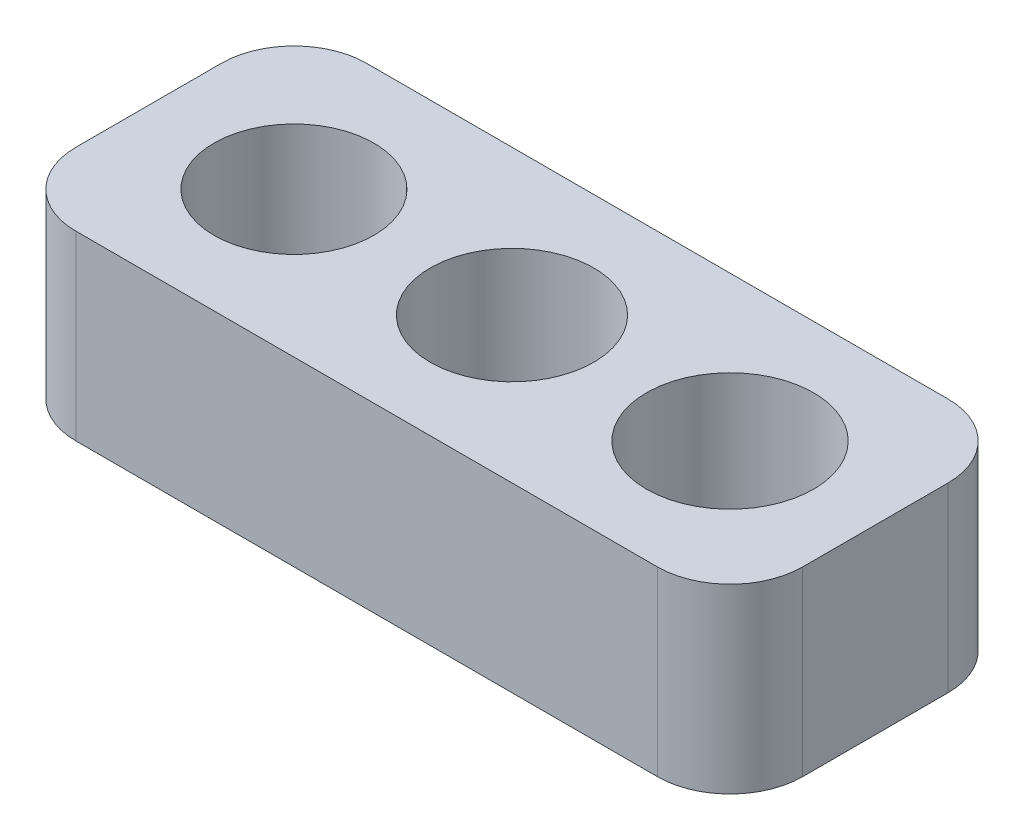
ISO-10303-21;
HEADER;
FILE_DESCRIPTION(('STEP AP214'),'2;1');
FILE_NAME('part.step','',(''),(''),'','','');
FILE_SCHEMA(('AUTOMOTIVE_DESIGN { 1 0 10303 214 1 1 1 1 }'));
ENDSEC;
DATA;
#1=APPLICATION_CONTEXT('core data for automotive mechanical design processes');
#2=APPLICATION_PROTOCOL_DEFINITION('international standard','automotive_design',2000,#1);
#3=PRODUCT_CONTEXT('',#1,'mechanical');
#4=PRODUCT('Part','Part','',(#3));
#5=PRODUCT_RELATED_PRODUCT_CATEGORY('part','',(#4));
#6=PRODUCT_DEFINITION_FORMATION('','',#4);
#7=PRODUCT_DEFINITION_CONTEXT('part definition',#1,'design');
#8=PRODUCT_DEFINITION('design','',#6,#7);
#9=PRODUCT_DEFINITION_SHAPE('','',#8);
#10=(LENGTH_UNIT() NAMED_UNIT(*) SI_UNIT(.MILLI.,.METRE.));
#11=(NAMED_UNIT(*) PLANE_ANGLE_UNIT() SI_UNIT($,.RADIAN.));
#12=(NAMED_UNIT(*) SI_UNIT($,.STERADIAN.) SOLID_ANGLE_UNIT());
#13=UNCERTAINTY_MEASURE_WITH_UNIT(LENGTH_MEASURE(1.E-05),#10,'distance_accuracy_value','');
#14=(GEOMETRIC_REPRESENTATION_CONTEXT(3) GLOBAL_UNCERTAINTY_ASSIGNED_CONTEXT((#13)) GLOBAL_UNIT_ASSIGNED_CONTEXT((#10,
#11,#12)) REPRESENTATION_CONTEXT('',''));
#15=CARTESIAN_POINT('',(0.,0.,0.));
#16=DIRECTION('',(0.,0.,1.));
#17=DIRECTION('',(1.,0.,0.));
#18=AXIS2_PLACEMENT_3D('',#15,#16,#17);
#19=CARTESIAN_POINT('',(0.,5.,0.));
#20=DIRECTION('',(0.,1.,0.));
#21=DIRECTION('',(0.,0.,1.));
#22=AXIS2_PLACEMENT_3D('',#19,#20,#21);
#23=PLANE('',#22);
#24=CARTESIAN_POINT('',(0.,5.,0.));
#25=DIRECTION('',(0.,1.,0.));
#26=DIRECTION('',(0.,0.,1.));
#27=AXIS2_PLACEMENT_3D('',#24,#25,#26);
#28=CIRCLE('',#27,2.25);
#29=CARTESIAN_POINT('',(0.,5.,2.25));
#30=VERTEX_POINT('',#29);
#31=EDGE_CURVE('E182',#30,#30,#28,.T.);
#32=ORIENTED_EDGE('',*,*,#31,.F.);
#33=EDGE_LOOP('',(#32));
#34=FACE_BOUND('',#33,.T.);
#35=DIRECTION('',(-1.,0.,0.));
#36=VECTOR('',#35,1.);
#37=CARTESIAN_POINT('',(-10.,5.,-4.));
#38=LINE('',#37,#36);
#39=CARTESIAN_POINT('',(8.,5.,-4.));
#40=VERTEX_POINT('',#39);
#41=CARTESIAN_POINT('',(-8.,5.,-4.));
#42=VERTEX_POINT('',#41);
#43=EDGE_CURVE('E177',#40,#42,#38,.T.);
#44=ORIENTED_EDGE('',*,*,#43,.T.);
#45=CARTESIAN_POINT('',(-8.,5.,-2.));
#46=DIRECTION('',(0.,1.,0.));
#47=DIRECTION('',(0.,0.,1.));
#48=AXIS2_PLACEMENT_3D('',#45,#46,#47);
#49=CIRCLE('',#48,2.);
#50=CARTESIAN_POINT('',(-10.,5.,-2.));
#51=VERTEX_POINT('',#50);
#52=EDGE_CURVE('E154',#42,#51,#49,.T.);
#53=ORIENTED_EDGE('',*,*,#52,.T.);
#54=DIRECTION('',(0.,0.,1.));
#55=VECTOR('',#54,1.);
#56=CARTESIAN_POINT('',(-10.,5.,-4.));
#57=LINE('',#56,#55);
#58=CARTESIAN_POINT('',(-10.,5.,2.));
#59=VERTEX_POINT('',#58);
#60=EDGE_CURVE('E124',#51,#59,#57,.T.);
#61=ORIENTED_EDGE('',*,*,#60,.T.);
#62=CARTESIAN_POINT('',(-8.,5.,2.));
#63=DIRECTION('',(0.,1.,0.));
#64=DIRECTION('',(0.,0.,1.));
#65=AXIS2_PLACEMENT_3D('',#62,#63,#64);
#66=CIRCLE('',#65,2.);
#67=CARTESIAN_POINT('',(-8.,5.,4.));
#68=VERTEX_POINT('',#67);
#69=EDGE_CURVE('E61',#59,#68,#66,.T.);
#70=ORIENTED_EDGE('',*,*,#69,.T.);
#71=DIRECTION('',(1.,0.,0.));
#72=VECTOR('',#71,1.);
#73=CARTESIAN_POINT('',(-10.,5.,4.));
#74=LINE('',#73,#72);
#75=CARTESIAN_POINT('',(8.,5.,4.));
#76=VERTEX_POINT('',#75);
#77=EDGE_CURVE('E140',#68,#76,#74,.T.);
#78=ORIENTED_EDGE('',*,*,#77,.T.);
#79=CARTESIAN_POINT('',(8.,5.,2.));
#80=DIRECTION('',(0.,1.,0.));
#81=DIRECTION('',(0.,0.,1.));
#82=AXIS2_PLACEMENT_3D('',#79,#80,#81);
#83=CIRCLE('',#82,2.);
#84=CARTESIAN_POINT('',(10.,5.,2.));
#85=VERTEX_POINT('',#84);
#86=EDGE_CURVE('E149',#76,#85,#83,.T.);
#87=ORIENTED_EDGE('',*,*,#86,.T.);
#88=DIRECTION('',(0.,0.,-1.));
#89=VECTOR('',#88,1.);
#90=CARTESIAN_POINT('',(10.,5.,-4.));
#91=LINE('',#90,#89);
#92=CARTESIAN_POINT('',(10.,5.,-2.));
#93=VERTEX_POINT('',#92);
#94=EDGE_CURVE('E134',#85,#93,#91,.T.);
#95=ORIENTED_EDGE('',*,*,#94,.T.);
#96=CARTESIAN_POINT('',(8.,5.,-2.));
#97=DIRECTION('',(0.,1.,0.));
#98=DIRECTION('',(0.,0.,1.));
#99=AXIS2_PLACEMENT_3D('',#96,#97,#98);
#100=CIRCLE('',#99,2.);
#101=EDGE_CURVE('E151',#93,#40,#100,.T.);
#102=ORIENTED_EDGE('',*,*,#101,.T.);
#103=EDGE_LOOP('',(#44,#53,#61,#70,#78,#87,#95,#102));
#104=FACE_BOUND('',#103,.T.);
#105=CARTESIAN_POINT('',(-6.,5.,0.));
#106=DIRECTION('',(0.,1.,0.));
#107=DIRECTION('',(0.,0.,1.));
#108=AXIS2_PLACEMENT_3D('',#105,#106,#107);
#109=CIRCLE('',#108,2.2);
#110=CARTESIAN_POINT('',(-6.,5.,2.2));
#111=VERTEX_POINT('',#110);
#112=EDGE_CURVE('E170',#111,#111,#109,.T.);
#113=ORIENTED_EDGE('',*,*,#112,.F.);
#114=EDGE_LOOP('',(#113));
#115=FACE_BOUND('',#114,.T.);
#116=CARTESIAN_POINT('',(6.,5.,0.));
#117=DIRECTION('',(0.,1.,0.));
#118=DIRECTION('',(0.,0.,1.));
#119=AXIS2_PLACEMENT_3D('',#116,#117,#118);
#120=CIRCLE('',#119,2.3);
#121=CARTESIAN_POINT('',(6.,5.,2.3));
#122=VERTEX_POINT('',#121);
#123=EDGE_CURVE('E187',#122,#122,#120,.T.);
#124=ORIENTED_EDGE('',*,*,#123,.F.);
#125=EDGE_LOOP('',(#124));
#126=FACE_BOUND('',#125,.T.);
#127=ADVANCED_FACE('F39',(#34,#104,#115,#126),#23,.T.);
#128=CARTESIAN_POINT('',(0.,0.,0.));
#129=DIRECTION('',(0.,1.,0.));
#130=DIRECTION('',(0.,0.,1.));
#131=AXIS2_PLACEMENT_3D('',#128,#129,#130);
#132=PLANE('',#131);
#133=DIRECTION('',(0.,0.,1.));
#134=VECTOR('',#133,1.);
#135=CARTESIAN_POINT('',(-10.,0.,-4.));
#136=LINE('',#135,#134);
#137=CARTESIAN_POINT('',(-10.,0.,-2.));
#138=VERTEX_POINT('',#137);
#139=CARTESIAN_POINT('',(-10.,0.,2.));
#140=VERTEX_POINT('',#139);
#141=EDGE_CURVE('E122',#138,#140,#136,.T.);
#142=ORIENTED_EDGE('',*,*,#141,.F.);
#143=CARTESIAN_POINT('',(-8.,0.,-2.));
#144=DIRECTION('',(0.,1.,0.));
#145=DIRECTION('',(0.,0.,1.));
#146=AXIS2_PLACEMENT_3D('',#143,#144,#145);
#147=CIRCLE('',#146,2.);
#148=CARTESIAN_POINT('',(-8.,0.,-4.));
#149=VERTEX_POINT('',#148);
#150=EDGE_CURVE('E105',#138,#149,#147,.F.);
#151=ORIENTED_EDGE('',*,*,#150,.T.);
#152=DIRECTION('',(-1.,0.,0.));
#153=VECTOR('',#152,1.);
#154=CARTESIAN_POINT('',(-10.,0.,-4.));
#155=LINE('',#154,#153);
#156=CARTESIAN_POINT('',(8.,0.,-4.));
#157=VERTEX_POINT('',#156);
#158=EDGE_CURVE('E132',#157,#149,#155,.T.);
#159=ORIENTED_EDGE('',*,*,#158,.F.);
#160=CARTESIAN_POINT('',(8.,0.,-2.));
#161=DIRECTION('',(0.,1.,0.));
#162=DIRECTION('',(0.,0.,1.));
#163=AXIS2_PLACEMENT_3D('',#160,#161,#162);
#164=CIRCLE('',#163,2.);
#165=CARTESIAN_POINT('',(10.,0.,-2.));
#166=VERTEX_POINT('',#165);
#167=EDGE_CURVE('E143',#157,#166,#164,.F.);
#168=ORIENTED_EDGE('',*,*,#167,.T.);
#169=DIRECTION('',(0.,0.,-1.));
#170=VECTOR('',#169,1.);
#171=CARTESIAN_POINT('',(10.,0.,-4.));
#172=LINE('',#171,#170);
#173=CARTESIAN_POINT('',(10.,0.,2.));
#174=VERTEX_POINT('',#173);
#175=EDGE_CURVE('E136',#174,#166,#172,.T.);
#176=ORIENTED_EDGE('',*,*,#175,.F.);
#177=CARTESIAN_POINT('',(8.,0.,2.));
#178=DIRECTION('',(0.,1.,0.));
#179=DIRECTION('',(0.,0.,1.));
#180=AXIS2_PLACEMENT_3D('',#177,#178,#179);
#181=CIRCLE('',#180,2.);
#182=CARTESIAN_POINT('',(8.,0.,4.));
#183=VERTEX_POINT('',#182);
#184=EDGE_CURVE('E125',#174,#183,#181,.F.);
#185=ORIENTED_EDGE('',*,*,#184,.T.);
#186=DIRECTION('',(1.,0.,0.));
#187=VECTOR('',#186,1.);
#188=CARTESIAN_POINT('',(-10.,0.,4.));
#189=LINE('',#188,#187);
#190=CARTESIAN_POINT('',(-8.,0.,4.));
#191=VERTEX_POINT('',#190);
#192=EDGE_CURVE('E131',#191,#183,#189,.T.);
#193=ORIENTED_EDGE('',*,*,#192,.F.);
#194=CARTESIAN_POINT('',(-8.,0.,2.));
#195=DIRECTION('',(0.,1.,0.));
#196=DIRECTION('',(0.,0.,1.));
#197=AXIS2_PLACEMENT_3D('',#194,#195,#196);
#198=CIRCLE('',#197,2.);
#199=EDGE_CURVE('E116',#191,#140,#198,.F.);
#200=ORIENTED_EDGE('',*,*,#199,.T.);
#201=EDGE_LOOP('',(#142,#151,#159,#168,#176,#185,#193,#200));
#202=FACE_BOUND('',#201,.T.);
#203=CARTESIAN_POINT('',(-6.,0.,0.));
#204=DIRECTION('',(0.,1.,0.));
#205=DIRECTION('',(0.,0.,1.));
#206=AXIS2_PLACEMENT_3D('',#203,#204,#205);
#207=CIRCLE('',#206,2.2);
#208=CARTESIAN_POINT('',(-6.,0.,2.2));
#209=VERTEX_POINT('',#208);
#210=EDGE_CURVE('E172',#209,#209,#207,.T.);
#211=ORIENTED_EDGE('',*,*,#210,.T.);
#212=EDGE_LOOP('',(#211));
#213=FACE_BOUND('',#212,.T.);
#214=CARTESIAN_POINT('',(0.,0.,0.));
#215=DIRECTION('',(0.,1.,0.));
#216=DIRECTION('',(0.,0.,1.));
#217=AXIS2_PLACEMENT_3D('',#214,#215,#216);
#218=CIRCLE('',#217,2.25);
#219=CARTESIAN_POINT('',(0.,0.,2.25));
#220=VERTEX_POINT('',#219);
#221=EDGE_CURVE('E184',#220,#220,#218,.T.);
#222=ORIENTED_EDGE('',*,*,#221,.T.);
#223=EDGE_LOOP('',(#222));
#224=FACE_BOUND('',#223,.T.);
#225=CARTESIAN_POINT('',(6.,0.,0.));
#226=DIRECTION('',(0.,1.,0.));
#227=DIRECTION('',(0.,0.,1.));
#228=AXIS2_PLACEMENT_3D('',#225,#226,#227);
#229=CIRCLE('',#228,2.3);
#230=CARTESIAN_POINT('',(6.,0.,2.3));
#231=VERTEX_POINT('',#230);
#232=EDGE_CURVE('E190',#231,#231,#229,.T.);
#233=ORIENTED_EDGE('',*,*,#232,.T.);
#234=EDGE_LOOP('',(#233));
#235=FACE_BOUND('',#234,.T.);
#236=ADVANCED_FACE('F128',(#202,#213,#224,#235),#132,.F.);
#237=CARTESIAN_POINT('',(10.,5.,-4.));
#238=DIRECTION('',(-1.,0.,0.));
#239=DIRECTION('',(0.,0.,1.));
#240=AXIS2_PLACEMENT_3D('',#237,#238,#239);
#241=PLANE('',#240);
#242=ORIENTED_EDGE('',*,*,#175,.T.);
#243=DIRECTION('',(0.,-1.,0.));
#244=VECTOR('',#243,1.);
#245=CARTESIAN_POINT('',(10.,5.,-2.));
#246=LINE('',#245,#244);
#247=EDGE_CURVE('E11',#166,#93,#246,.F.);
#248=ORIENTED_EDGE('',*,*,#247,.T.);
#249=ORIENTED_EDGE('',*,*,#94,.F.);
#250=DIRECTION('',(0.,-1.,0.));
#251=VECTOR('',#250,1.);
#252=CARTESIAN_POINT('',(10.,5.,2.));
#253=LINE('',#252,#251);
#254=EDGE_CURVE('E47',#85,#174,#253,.T.);
#255=ORIENTED_EDGE('',*,*,#254,.T.);
#256=EDGE_LOOP('',(#242,#248,#249,#255));
#257=FACE_BOUND('',#256,.T.);
#258=ADVANCED_FACE('F165',(#257),#241,.F.);
#259=CARTESIAN_POINT('',(-10.,5.,-4.));
#260=DIRECTION('',(0.,0.,1.));
#261=DIRECTION('',(1.,0.,0.));
#262=AXIS2_PLACEMENT_3D('',#259,#260,#261);
#263=PLANE('',#262);
#264=ORIENTED_EDGE('',*,*,#158,.T.);
#265=DIRECTION('',(0.,-1.,0.));
#266=VECTOR('',#265,1.);
#267=CARTESIAN_POINT('',(-8.,5.,-4.));
#268=LINE('',#267,#266);
#269=EDGE_CURVE('E110',#149,#42,#268,.F.);
#270=ORIENTED_EDGE('',*,*,#269,.T.);
#271=ORIENTED_EDGE('',*,*,#43,.F.);
#272=DIRECTION('',(0.,-1.,0.));
#273=VECTOR('',#272,1.);
#274=CARTESIAN_POINT('',(8.,5.,-4.));
#275=LINE('',#274,#273);
#276=EDGE_CURVE('E115',#40,#157,#275,.T.);
#277=ORIENTED_EDGE('',*,*,#276,.T.);
#278=EDGE_LOOP('',(#264,#270,#271,#277));
#279=FACE_BOUND('',#278,.T.);
#280=ADVANCED_FACE('F217',(#279),#263,.F.);
#281=CARTESIAN_POINT('',(-10.,5.,-4.));
#282=DIRECTION('',(1.,0.,0.));
#283=DIRECTION('',(0.,0.,-1.));
#284=AXIS2_PLACEMENT_3D('',#281,#282,#283);
#285=PLANE('',#284);
#286=ORIENTED_EDGE('',*,*,#60,.F.);
#287=DIRECTION('',(0.,-1.,0.));
#288=VECTOR('',#287,1.);
#289=CARTESIAN_POINT('',(-10.,5.,-2.));
#290=LINE('',#289,#288);
#291=EDGE_CURVE('E109',#51,#138,#290,.T.);
#292=ORIENTED_EDGE('',*,*,#291,.T.);
#293=ORIENTED_EDGE('',*,*,#141,.T.);
#294=DIRECTION('',(0.,-1.,0.));
#295=VECTOR('',#294,1.);
#296=CARTESIAN_POINT('',(-10.,5.,2.));
#297=LINE('',#296,#295);
#298=EDGE_CURVE('E126',#140,#59,#297,.F.);
#299=ORIENTED_EDGE('',*,*,#298,.T.);
#300=EDGE_LOOP('',(#286,#292,#293,#299));
#301=FACE_BOUND('',#300,.T.);
#302=ADVANCED_FACE('F121',(#301),#285,.F.);
#303=CARTESIAN_POINT('',(-10.,5.,4.));
#304=DIRECTION('',(0.,0.,-1.));
#305=DIRECTION('',(-1.,0.,0.));
#306=AXIS2_PLACEMENT_3D('',#303,#304,#305);
#307=PLANE('',#306);
#308=ORIENTED_EDGE('',*,*,#77,.F.);
#309=DIRECTION('',(0.,-1.,0.));
#310=VECTOR('',#309,1.);
#311=CARTESIAN_POINT('',(-8.,5.,4.));
#312=LINE('',#311,#310);
#313=EDGE_CURVE('E157',#68,#191,#312,.T.);
#314=ORIENTED_EDGE('',*,*,#313,.T.);
#315=ORIENTED_EDGE('',*,*,#192,.T.);
#316=DIRECTION('',(0.,-1.,0.));
#317=VECTOR('',#316,1.);
#318=CARTESIAN_POINT('',(8.,5.,4.));
#319=LINE('',#318,#317);
#320=EDGE_CURVE('E54',#183,#76,#319,.F.);
#321=ORIENTED_EDGE('',*,*,#320,.T.);
#322=EDGE_LOOP('',(#308,#314,#315,#321));
#323=FACE_BOUND('',#322,.T.);
#324=ADVANCED_FACE('F212',(#323),#307,.F.);
#325=CARTESIAN_POINT('',(-6.,5.,0.));
#326=DIRECTION('',(0.,-1.,0.));
#327=DIRECTION('',(0.,0.,-1.));
#328=AXIS2_PLACEMENT_3D('',#325,#326,#327);
#329=CYLINDRICAL_SURFACE('',#328,2.2);
#330=ORIENTED_EDGE('',*,*,#112,.T.);
#331=EDGE_LOOP('',(#330));
#332=FACE_BOUND('',#331,.T.);
#333=ORIENTED_EDGE('',*,*,#210,.F.);
#334=EDGE_LOOP('',(#333));
#335=FACE_BOUND('',#334,.T.);
#336=ADVANCED_FACE('F209',(#332,#335),#329,.F.);
#337=CARTESIAN_POINT('',(0.,5.,0.));
#338=DIRECTION('',(0.,-1.,0.));
#339=DIRECTION('',(0.,0.,-1.));
#340=AXIS2_PLACEMENT_3D('',#337,#338,#339);
#341=CYLINDRICAL_SURFACE('',#340,2.25);
#342=ORIENTED_EDGE('',*,*,#31,.T.);
#343=EDGE_LOOP('',(#342));
#344=FACE_BOUND('',#343,.T.);
#345=ORIENTED_EDGE('',*,*,#221,.F.);
#346=EDGE_LOOP('',(#345));
#347=FACE_BOUND('',#346,.T.);
#348=ADVANCED_FACE('F243',(#344,#347),#341,.F.);
#349=CARTESIAN_POINT('',(6.,5.,0.));
#350=DIRECTION('',(0.,-1.,0.));
#351=DIRECTION('',(0.,0.,-1.));
#352=AXIS2_PLACEMENT_3D('',#349,#350,#351);
#353=CYLINDRICAL_SURFACE('',#352,2.3);
#354=ORIENTED_EDGE('',*,*,#123,.T.);
#355=EDGE_LOOP('',(#354));
#356=FACE_BOUND('',#355,.T.);
#357=ORIENTED_EDGE('',*,*,#232,.F.);
#358=EDGE_LOOP('',(#357));
#359=FACE_BOUND('',#358,.T.);
#360=ADVANCED_FACE('F196',(#356,#359),#353,.F.);
#361=CARTESIAN_POINT('',(-8.,5.,-2.));
#362=DIRECTION('',(0.,-1.,0.));
#363=DIRECTION('',(0.,0.,-1.));
#364=AXIS2_PLACEMENT_3D('',#361,#362,#363);
#365=CYLINDRICAL_SURFACE('',#364,2.);
#366=ORIENTED_EDGE('',*,*,#52,.F.);
#367=ORIENTED_EDGE('',*,*,#269,.F.);
#368=ORIENTED_EDGE('',*,*,#150,.F.);
#369=ORIENTED_EDGE('',*,*,#291,.F.);
#370=EDGE_LOOP('',(#366,#367,#368,#369));
#371=FACE_BOUND('',#370,.T.);
#372=ADVANCED_FACE('F108',(#371),#365,.T.);
#373=CARTESIAN_POINT('',(-8.,5.,2.));
#374=DIRECTION('',(0.,-1.,0.));
#375=DIRECTION('',(0.,0.,-1.));
#376=AXIS2_PLACEMENT_3D('',#373,#374,#375);
#377=CYLINDRICAL_SURFACE('',#376,2.);
#378=ORIENTED_EDGE('',*,*,#69,.F.);
#379=ORIENTED_EDGE('',*,*,#298,.F.);
#380=ORIENTED_EDGE('',*,*,#199,.F.);
#381=ORIENTED_EDGE('',*,*,#313,.F.);
#382=EDGE_LOOP('',(#378,#379,#380,#381));
#383=FACE_BOUND('',#382,.T.);
#384=ADVANCED_FACE('F225',(#383),#377,.T.);
#385=CARTESIAN_POINT('',(8.,5.,-2.));
#386=DIRECTION('',(0.,-1.,0.));
#387=DIRECTION('',(0.,0.,-1.));
#388=AXIS2_PLACEMENT_3D('',#385,#386,#387);
#389=CYLINDRICAL_SURFACE('',#388,2.);
#390=ORIENTED_EDGE('',*,*,#101,.F.);
#391=ORIENTED_EDGE('',*,*,#247,.F.);
#392=ORIENTED_EDGE('',*,*,#167,.F.);
#393=ORIENTED_EDGE('',*,*,#276,.F.);
#394=EDGE_LOOP('',(#390,#391,#392,#393));
#395=FACE_BOUND('',#394,.T.);
#396=ADVANCED_FACE('F227',(#395),#389,.T.);
#397=CARTESIAN_POINT('',(8.,5.,2.));
#398=DIRECTION('',(0.,-1.,0.));
#399=DIRECTION('',(0.,0.,-1.));
#400=AXIS2_PLACEMENT_3D('',#397,#398,#399);
#401=CYLINDRICAL_SURFACE('',#400,2.);
#402=ORIENTED_EDGE('',*,*,#86,.F.);
#403=ORIENTED_EDGE('',*,*,#320,.F.);
#404=ORIENTED_EDGE('',*,*,#184,.F.);
#405=ORIENTED_EDGE('',*,*,#254,.F.);
#406=EDGE_LOOP('',(#402,#403,#404,#405));
#407=FACE_BOUND('',#406,.T.);
#408=ADVANCED_FACE('F41',(#407),#401,.T.);
#409=CLOSED_SHELL('',(#127,#236,#258,#280,#302,#324,#336,#348,#360,#372,#384,#396,#408));
#410=MANIFOLD_SOLID_BREP('B2',#409);
#411=ADVANCED_BREP_SHAPE_REPRESENTATION('',(#18,#410),#14);
#412=SHAPE_DEFINITION_REPRESENTATION(#9,#411);
ENDSEC;
END-ISO-10303-21;
